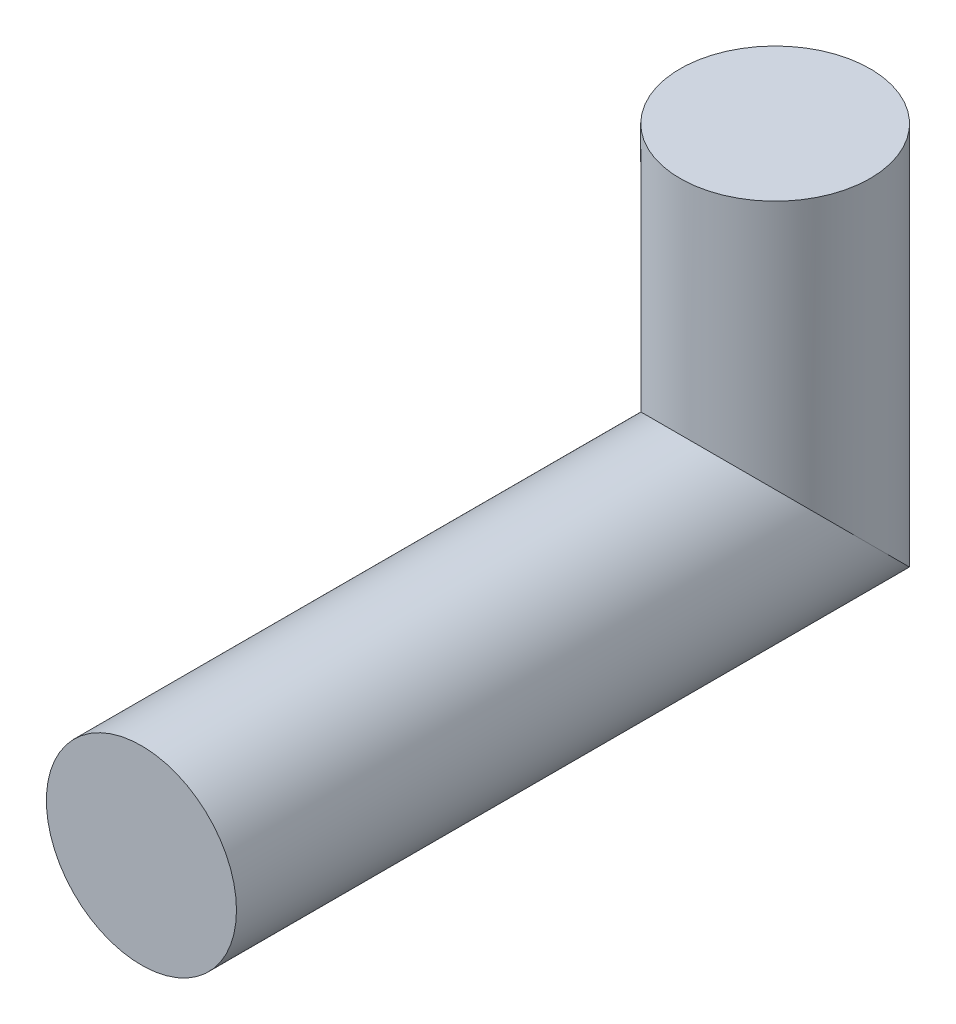
ISO-10303-21;
HEADER;
FILE_DESCRIPTION(('STEP AP214'),'2;1');
FILE_NAME('part.step','',(''),(''),'','','');
FILE_SCHEMA(('AUTOMOTIVE_DESIGN { 1 0 10303 214 1 1 1 1 }'));
ENDSEC;
DATA;
#1=APPLICATION_CONTEXT('core data for automotive mechanical design processes');
#2=APPLICATION_PROTOCOL_DEFINITION('international standard','automotive_design',2000,#1);
#3=PRODUCT_CONTEXT('',#1,'mechanical');
#4=PRODUCT('Part','Part','',(#3));
#5=PRODUCT_RELATED_PRODUCT_CATEGORY('part','',(#4));
#6=PRODUCT_DEFINITION_FORMATION('','',#4);
#7=PRODUCT_DEFINITION_CONTEXT('part definition',#1,'design');
#8=PRODUCT_DEFINITION('design','',#6,#7);
#9=PRODUCT_DEFINITION_SHAPE('','',#8);
#10=(LENGTH_UNIT() NAMED_UNIT(*) SI_UNIT(.MILLI.,.METRE.));
#11=(NAMED_UNIT(*) PLANE_ANGLE_UNIT() SI_UNIT($,.RADIAN.));
#12=(NAMED_UNIT(*) SI_UNIT($,.STERADIAN.) SOLID_ANGLE_UNIT());
#13=UNCERTAINTY_MEASURE_WITH_UNIT(LENGTH_MEASURE(1.E-05),#10,'distance_accuracy_value','');
#14=(GEOMETRIC_REPRESENTATION_CONTEXT(3) GLOBAL_UNCERTAINTY_ASSIGNED_CONTEXT((#13)) GLOBAL_UNIT_ASSIGNED_CONTEXT((#10,
#11,#12)) REPRESENTATION_CONTEXT('',''));
#15=CARTESIAN_POINT('',(0.,0.,0.));
#16=DIRECTION('',(0.,0.,1.));
#17=DIRECTION('',(1.,0.,0.));
#18=AXIS2_PLACEMENT_3D('',#15,#16,#17);
#19=CARTESIAN_POINT('',(0.,63.5,-127.));
#20=DIRECTION('',(0.,-1.,0.));
#21=DIRECTION('',(1.,0.,0.));
#22=AXIS2_PLACEMENT_3D('',#19,#20,#21);
#23=PLANE('',#22);
#24=CARTESIAN_POINT('',(0.,63.5,-127.));
#25=DIRECTION('',(0.,-1.,0.));
#26=DIRECTION('',(1.,0.,0.));
#27=AXIS2_PLACEMENT_3D('',#24,#25,#26);
#28=CIRCLE('',#27,19.05);
#29=CARTESIAN_POINT('',(19.05,63.5,-127.));
#30=VERTEX_POINT('',#29);
#31=EDGE_CURVE('E40',#30,#30,#28,.T.);
#32=ORIENTED_EDGE('',*,*,#31,.F.);
#33=EDGE_LOOP('',(#32));
#34=FACE_BOUND('',#33,.T.);
#35=ADVANCED_FACE('F37',(#34),#23,.F.);
#36=CARTESIAN_POINT('',(0.,0.,0.));
#37=DIRECTION('',(0.,0.,1.));
#38=DIRECTION('',(1.,0.,0.));
#39=AXIS2_PLACEMENT_3D('',#36,#37,#38);
#40=PLANE('',#39);
#41=CARTESIAN_POINT('',(0.,0.,0.));
#42=DIRECTION('',(0.,0.,1.));
#43=DIRECTION('',(1.,0.,0.));
#44=AXIS2_PLACEMENT_3D('',#41,#42,#43);
#45=CIRCLE('',#44,19.05);
#46=CARTESIAN_POINT('',(19.05,0.,0.));
#47=VERTEX_POINT('',#46);
#48=EDGE_CURVE('E45',#47,#47,#45,.T.);
#49=ORIENTED_EDGE('',*,*,#48,.T.);
#50=EDGE_LOOP('',(#49));
#51=FACE_BOUND('',#50,.T.);
#52=ADVANCED_FACE('F60',(#51),#40,.T.);
#53=CARTESIAN_POINT('',(0.,-42.01,-127.));
#54=DIRECTION('',(0.,1.,0.));
#55=DIRECTION('',(0.,0.,1.));
#56=AXIS2_PLACEMENT_3D('',#53,#54,#55);
#57=CYLINDRICAL_SURFACE('',#56,19.05);
#58=CARTESIAN_POINT('',(0.,0.,-127.));
#59=DIRECTION('',(0.,0.707106781186547,-0.707106781186547));
#60=DIRECTION('',(0.,-0.707106781186548,-0.707106781186548));
#61=AXIS2_PLACEMENT_3D('',#58,#59,#60);
#62=ELLIPSE('',#61,26.9407683632075,19.05);
#63=CARTESIAN_POINT('',(0.,-19.05,-146.05));
#64=VERTEX_POINT('',#63);
#65=EDGE_CURVE('E10',#64,#64,#62,.T.);
#66=ORIENTED_EDGE('',*,*,#65,.T.);
#67=EDGE_LOOP('',(#66));
#68=FACE_BOUND('',#67,.T.);
#69=ORIENTED_EDGE('',*,*,#31,.T.);
#70=EDGE_LOOP('',(#69));
#71=FACE_BOUND('',#70,.T.);
#72=ADVANCED_FACE('F57',(#68,#71),#57,.T.);
#73=CARTESIAN_POINT('',(0.,0.,0.));
#74=DIRECTION('',(0.,0.,-1.));
#75=DIRECTION('',(-1.,0.,0.));
#76=AXIS2_PLACEMENT_3D('',#73,#74,#75);
#77=CYLINDRICAL_SURFACE('',#76,19.05);
#78=ORIENTED_EDGE('',*,*,#48,.F.);
#79=EDGE_LOOP('',(#78));
#80=FACE_BOUND('',#79,.T.);
#81=ORIENTED_EDGE('',*,*,#65,.F.);
#82=EDGE_LOOP('',(#81));
#83=FACE_BOUND('',#82,.T.);
#84=ADVANCED_FACE('F64',(#80,#83),#77,.T.);
#85=CLOSED_SHELL('',(#35,#52,#72,#84));
#86=MANIFOLD_SOLID_BREP('B2',#85);
#87=ADVANCED_BREP_SHAPE_REPRESENTATION('',(#18,#86),#14);
#88=SHAPE_DEFINITION_REPRESENTATION(#9,#87);
ENDSEC;
END-ISO-10303-21;
